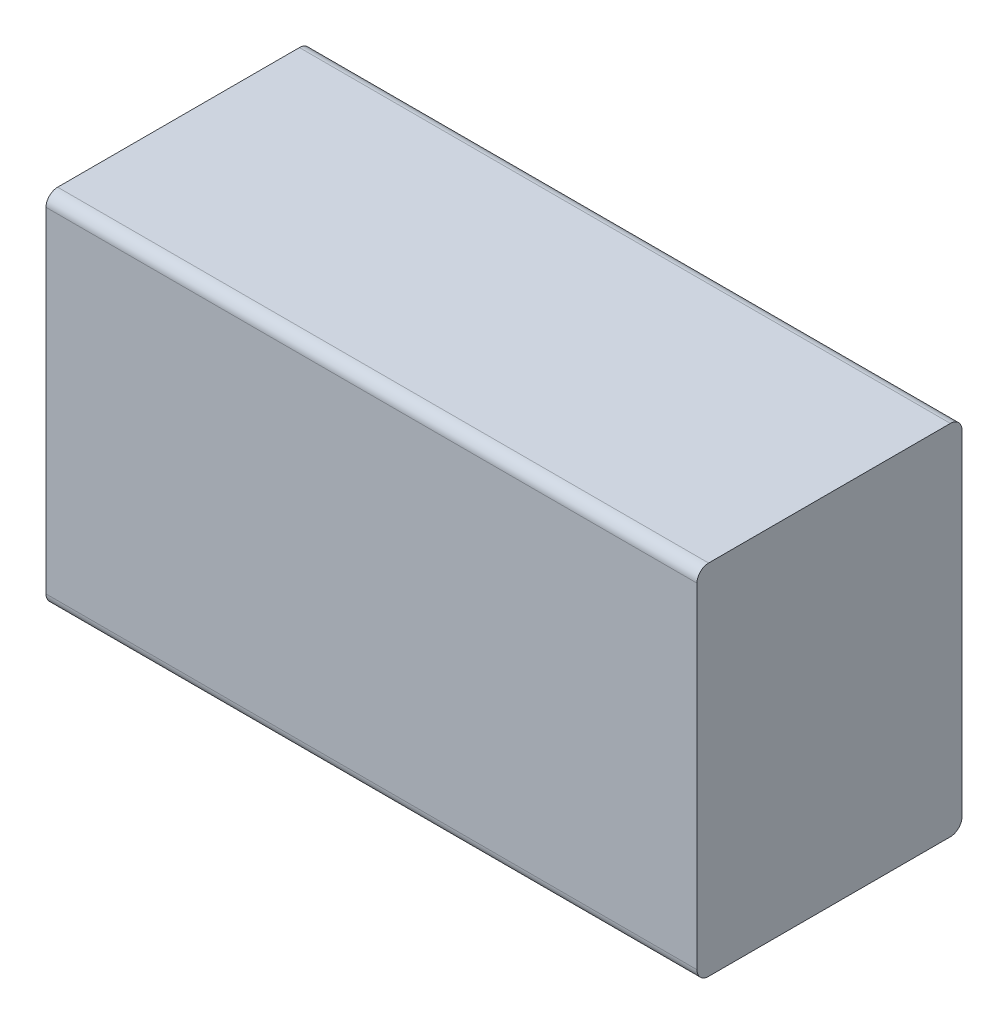
ISO-10303-21;
HEADER;
FILE_DESCRIPTION(('STEP AP214'),'2;1');
FILE_NAME('part.step','',(''),(''),'','','');
FILE_SCHEMA(('AUTOMOTIVE_DESIGN { 1 0 10303 214 1 1 1 1 }'));
ENDSEC;
DATA;
#1=APPLICATION_CONTEXT('core data for automotive mechanical design processes');
#2=APPLICATION_PROTOCOL_DEFINITION('international standard','automotive_design',2000,#1);
#3=PRODUCT_CONTEXT('',#1,'mechanical');
#4=PRODUCT('Part','Part','',(#3));
#5=PRODUCT_RELATED_PRODUCT_CATEGORY('part','',(#4));
#6=PRODUCT_DEFINITION_FORMATION('','',#4);
#7=PRODUCT_DEFINITION_CONTEXT('part definition',#1,'design');
#8=PRODUCT_DEFINITION('design','',#6,#7);
#9=PRODUCT_DEFINITION_SHAPE('','',#8);
#10=(LENGTH_UNIT() NAMED_UNIT(*) SI_UNIT(.MILLI.,.METRE.));
#11=(NAMED_UNIT(*) PLANE_ANGLE_UNIT() SI_UNIT($,.RADIAN.));
#12=(NAMED_UNIT(*) SI_UNIT($,.STERADIAN.) SOLID_ANGLE_UNIT());
#13=UNCERTAINTY_MEASURE_WITH_UNIT(LENGTH_MEASURE(1.E-05),#10,'distance_accuracy_value','');
#14=(GEOMETRIC_REPRESENTATION_CONTEXT(3) GLOBAL_UNCERTAINTY_ASSIGNED_CONTEXT((#13)) GLOBAL_UNIT_ASSIGNED_CONTEXT((#10,
#11,#12)) REPRESENTATION_CONTEXT('',''));
#15=CARTESIAN_POINT('',(0.,0.,0.));
#16=DIRECTION('',(0.,0.,1.));
#17=DIRECTION('',(1.,0.,0.));
#18=AXIS2_PLACEMENT_3D('',#15,#16,#17);
#19=CARTESIAN_POINT('',(-0.7,-0.385,0.3));
#20=DIRECTION('',(1.,0.,0.));
#21=DIRECTION('',(0.,1.,0.));
#22=AXIS2_PLACEMENT_3D('',#19,#20,#21);
#23=PLANE('',#22);
#24=DIRECTION('',(0.,0.,-1.));
#25=VECTOR('',#24,1.);
#26=CARTESIAN_POINT('',(-0.7,0.385,0.3));
#27=LINE('',#26,#25);
#28=CARTESIAN_POINT('',(-0.7,0.385,0.56));
#29=VERTEX_POINT('',#28);
#30=CARTESIAN_POINT('',(-0.7,0.385,0.04));
#31=VERTEX_POINT('',#30);
#32=EDGE_CURVE('E42',#29,#31,#27,.T.);
#33=ORIENTED_EDGE('',*,*,#32,.T.);
#34=CARTESIAN_POINT('',(-0.7,0.36,0.04));
#35=DIRECTION('',(-1.,0.,0.));
#36=DIRECTION('',(0.,0.,-1.));
#37=AXIS2_PLACEMENT_3D('',#34,#35,#36);
#38=CIRCLE('',#37,0.025);
#39=CARTESIAN_POINT('',(-0.7,0.36,0.015));
#40=VERTEX_POINT('',#39);
#41=EDGE_CURVE('E139',#31,#40,#38,.T.);
#42=ORIENTED_EDGE('',*,*,#41,.T.);
#43=DIRECTION('',(0.,1.,0.));
#44=VECTOR('',#43,1.);
#45=CARTESIAN_POINT('',(-0.7,-0.385,0.015));
#46=LINE('',#45,#44);
#47=CARTESIAN_POINT('',(-0.7,-0.36,0.015));
#48=VERTEX_POINT('',#47);
#49=EDGE_CURVE('E28',#48,#40,#46,.T.);
#50=ORIENTED_EDGE('',*,*,#49,.F.);
#51=CARTESIAN_POINT('',(-0.7,-0.36,0.04));
#52=DIRECTION('',(-1.,0.,0.));
#53=DIRECTION('',(0.,0.,-1.));
#54=AXIS2_PLACEMENT_3D('',#51,#52,#53);
#55=CIRCLE('',#54,0.025);
#56=CARTESIAN_POINT('',(-0.7,-0.385,0.04));
#57=VERTEX_POINT('',#56);
#58=EDGE_CURVE('E157',#48,#57,#55,.T.);
#59=ORIENTED_EDGE('',*,*,#58,.T.);
#60=DIRECTION('',(0.,0.,-1.));
#61=VECTOR('',#60,1.);
#62=CARTESIAN_POINT('',(-0.7,-0.385,0.3));
#63=LINE('',#62,#61);
#64=CARTESIAN_POINT('',(-0.7,-0.385,0.56));
#65=VERTEX_POINT('',#64);
#66=EDGE_CURVE('E110',#65,#57,#63,.T.);
#67=ORIENTED_EDGE('',*,*,#66,.F.);
#68=CARTESIAN_POINT('',(-0.7,-0.36,0.56));
#69=DIRECTION('',(-1.,0.,0.));
#70=DIRECTION('',(0.,0.,-1.));
#71=AXIS2_PLACEMENT_3D('',#68,#69,#70);
#72=CIRCLE('',#71,0.025);
#73=CARTESIAN_POINT('',(-0.7,-0.36,0.585));
#74=VERTEX_POINT('',#73);
#75=EDGE_CURVE('E119',#65,#74,#72,.T.);
#76=ORIENTED_EDGE('',*,*,#75,.T.);
#77=DIRECTION('',(0.,1.,0.));
#78=VECTOR('',#77,1.);
#79=CARTESIAN_POINT('',(-0.7,-0.385,0.585));
#80=LINE('',#79,#78);
#81=CARTESIAN_POINT('',(-0.7,0.36,0.585));
#82=VERTEX_POINT('',#81);
#83=EDGE_CURVE('E21',#74,#82,#80,.T.);
#84=ORIENTED_EDGE('',*,*,#83,.T.);
#85=CARTESIAN_POINT('',(-0.7,0.36,0.56));
#86=DIRECTION('',(-1.,0.,0.));
#87=DIRECTION('',(0.,0.,-1.));
#88=AXIS2_PLACEMENT_3D('',#85,#86,#87);
#89=CIRCLE('',#88,0.025);
#90=EDGE_CURVE('E193',#82,#29,#89,.T.);
#91=ORIENTED_EDGE('',*,*,#90,.T.);
#92=EDGE_LOOP('',(#33,#42,#50,#59,#67,#76,#84,#91));
#93=FACE_BOUND('',#92,.T.);
#94=ADVANCED_FACE('F17',(#93),#23,.F.);
#95=CARTESIAN_POINT('',(0.7,-0.385,0.3));
#96=DIRECTION('',(1.,0.,0.));
#97=DIRECTION('',(0.,1.,0.));
#98=AXIS2_PLACEMENT_3D('',#95,#96,#97);
#99=PLANE('',#98);
#100=DIRECTION('',(0.,1.,0.));
#101=VECTOR('',#100,1.);
#102=CARTESIAN_POINT('',(0.7,-0.385,0.015));
#103=LINE('',#102,#101);
#104=CARTESIAN_POINT('',(0.7,-0.36,0.015));
#105=VERTEX_POINT('',#104);
#106=CARTESIAN_POINT('',(0.7,0.36,0.015));
#107=VERTEX_POINT('',#106);
#108=EDGE_CURVE('E11',#105,#107,#103,.T.);
#109=ORIENTED_EDGE('',*,*,#108,.T.);
#110=CARTESIAN_POINT('',(0.7,0.36,0.04));
#111=DIRECTION('',(1.,0.,0.));
#112=DIRECTION('',(0.,0.,-1.));
#113=AXIS2_PLACEMENT_3D('',#110,#111,#112);
#114=CIRCLE('',#113,0.025);
#115=CARTESIAN_POINT('',(0.7,0.385,0.04));
#116=VERTEX_POINT('',#115);
#117=EDGE_CURVE('E147',#107,#116,#114,.T.);
#118=ORIENTED_EDGE('',*,*,#117,.T.);
#119=DIRECTION('',(0.,0.,-1.));
#120=VECTOR('',#119,1.);
#121=CARTESIAN_POINT('',(0.7,0.385,0.3));
#122=LINE('',#121,#120);
#123=CARTESIAN_POINT('',(0.7,0.385,0.56));
#124=VERTEX_POINT('',#123);
#125=EDGE_CURVE('E144',#124,#116,#122,.T.);
#126=ORIENTED_EDGE('',*,*,#125,.F.);
#127=CARTESIAN_POINT('',(0.7,0.36,0.56));
#128=DIRECTION('',(1.,0.,0.));
#129=DIRECTION('',(0.,0.,-1.));
#130=AXIS2_PLACEMENT_3D('',#127,#128,#129);
#131=CIRCLE('',#130,0.025);
#132=CARTESIAN_POINT('',(0.7,0.36,0.585));
#133=VERTEX_POINT('',#132);
#134=EDGE_CURVE('E156',#124,#133,#131,.T.);
#135=ORIENTED_EDGE('',*,*,#134,.T.);
#136=DIRECTION('',(0.,1.,0.));
#137=VECTOR('',#136,1.);
#138=CARTESIAN_POINT('',(0.7,-0.385,0.585));
#139=LINE('',#138,#137);
#140=CARTESIAN_POINT('',(0.7,-0.36,0.585));
#141=VERTEX_POINT('',#140);
#142=EDGE_CURVE('E126',#141,#133,#139,.T.);
#143=ORIENTED_EDGE('',*,*,#142,.F.);
#144=CARTESIAN_POINT('',(0.7,-0.36,0.56));
#145=DIRECTION('',(1.,0.,0.));
#146=DIRECTION('',(0.,0.,-1.));
#147=AXIS2_PLACEMENT_3D('',#144,#145,#146);
#148=CIRCLE('',#147,0.025);
#149=CARTESIAN_POINT('',(0.7,-0.385,0.56));
#150=VERTEX_POINT('',#149);
#151=EDGE_CURVE('E117',#141,#150,#148,.T.);
#152=ORIENTED_EDGE('',*,*,#151,.T.);
#153=DIRECTION('',(0.,0.,-1.));
#154=VECTOR('',#153,1.);
#155=CARTESIAN_POINT('',(0.7,-0.385,0.3));
#156=LINE('',#155,#154);
#157=CARTESIAN_POINT('',(0.7,-0.385,0.04));
#158=VERTEX_POINT('',#157);
#159=EDGE_CURVE('E98',#150,#158,#156,.T.);
#160=ORIENTED_EDGE('',*,*,#159,.T.);
#161=CARTESIAN_POINT('',(0.7,-0.36,0.04));
#162=DIRECTION('',(1.,0.,0.));
#163=DIRECTION('',(0.,0.,-1.));
#164=AXIS2_PLACEMENT_3D('',#161,#162,#163);
#165=CIRCLE('',#164,0.025);
#166=EDGE_CURVE('E121',#158,#105,#165,.T.);
#167=ORIENTED_EDGE('',*,*,#166,.T.);
#168=EDGE_LOOP('',(#109,#118,#126,#135,#143,#152,#160,#167));
#169=FACE_BOUND('',#168,.T.);
#170=ADVANCED_FACE('F123',(#169),#99,.T.);
#171=CARTESIAN_POINT('',(0.,-0.385,0.015));
#172=DIRECTION('',(0.,0.,-1.));
#173=DIRECTION('',(0.,-1.,0.));
#174=AXIS2_PLACEMENT_3D('',#171,#172,#173);
#175=PLANE('',#174);
#176=ORIENTED_EDGE('',*,*,#49,.T.);
#177=DIRECTION('',(1.,0.,0.));
#178=VECTOR('',#177,1.);
#179=CARTESIAN_POINT('',(0.,0.36,0.015));
#180=LINE('',#179,#178);
#181=EDGE_CURVE('E141',#40,#107,#180,.T.);
#182=ORIENTED_EDGE('',*,*,#181,.T.);
#183=ORIENTED_EDGE('',*,*,#108,.F.);
#184=DIRECTION('',(-1.,0.,0.));
#185=VECTOR('',#184,1.);
#186=CARTESIAN_POINT('',(0.,-0.36,0.015));
#187=LINE('',#186,#185);
#188=EDGE_CURVE('E152',#105,#48,#187,.T.);
#189=ORIENTED_EDGE('',*,*,#188,.T.);
#190=EDGE_LOOP('',(#176,#182,#183,#189));
#191=FACE_BOUND('',#190,.T.);
#192=ADVANCED_FACE('F19',(#191),#175,.T.);
#193=CARTESIAN_POINT('',(0.,-0.385,0.585));
#194=DIRECTION('',(0.,0.,-1.));
#195=DIRECTION('',(0.,-1.,0.));
#196=AXIS2_PLACEMENT_3D('',#193,#194,#195);
#197=PLANE('',#196);
#198=ORIENTED_EDGE('',*,*,#142,.T.);
#199=DIRECTION('',(-1.,0.,0.));
#200=VECTOR('',#199,1.);
#201=CARTESIAN_POINT('',(-0.7,0.36,0.585));
#202=LINE('',#201,#200);
#203=EDGE_CURVE('E151',#133,#82,#202,.T.);
#204=ORIENTED_EDGE('',*,*,#203,.T.);
#205=ORIENTED_EDGE('',*,*,#83,.F.);
#206=DIRECTION('',(1.,0.,0.));
#207=VECTOR('',#206,1.);
#208=CARTESIAN_POINT('',(0.7,-0.36,0.585));
#209=LINE('',#208,#207);
#210=EDGE_CURVE('E129',#74,#141,#209,.T.);
#211=ORIENTED_EDGE('',*,*,#210,.T.);
#212=EDGE_LOOP('',(#198,#204,#205,#211));
#213=FACE_BOUND('',#212,.T.);
#214=ADVANCED_FACE('F215',(#213),#197,.F.);
#215=CARTESIAN_POINT('',(0.,0.385,0.3));
#216=DIRECTION('',(0.,1.,0.));
#217=DIRECTION('',(1.,0.,0.));
#218=AXIS2_PLACEMENT_3D('',#215,#216,#217);
#219=PLANE('',#218);
#220=ORIENTED_EDGE('',*,*,#125,.T.);
#221=DIRECTION('',(-1.,0.,0.));
#222=VECTOR('',#221,1.);
#223=CARTESIAN_POINT('',(0.,0.385,0.04));
#224=LINE('',#223,#222);
#225=EDGE_CURVE('E111',#116,#31,#224,.T.);
#226=ORIENTED_EDGE('',*,*,#225,.T.);
#227=ORIENTED_EDGE('',*,*,#32,.F.);
#228=DIRECTION('',(1.,0.,0.));
#229=VECTOR('',#228,1.);
#230=CARTESIAN_POINT('',(0.7,0.385,0.56));
#231=LINE('',#230,#229);
#232=EDGE_CURVE('E161',#29,#124,#231,.T.);
#233=ORIENTED_EDGE('',*,*,#232,.T.);
#234=EDGE_LOOP('',(#220,#226,#227,#233));
#235=FACE_BOUND('',#234,.T.);
#236=ADVANCED_FACE('F168',(#235),#219,.T.);
#237=CARTESIAN_POINT('',(0.,-0.385,0.3));
#238=DIRECTION('',(0.,-1.,0.));
#239=DIRECTION('',(0.,0.,-1.));
#240=AXIS2_PLACEMENT_3D('',#237,#238,#239);
#241=PLANE('',#240);
#242=ORIENTED_EDGE('',*,*,#159,.F.);
#243=DIRECTION('',(-1.,0.,0.));
#244=VECTOR('',#243,1.);
#245=CARTESIAN_POINT('',(-0.7,-0.385,0.56));
#246=LINE('',#245,#244);
#247=EDGE_CURVE('E101',#150,#65,#246,.T.);
#248=ORIENTED_EDGE('',*,*,#247,.T.);
#249=ORIENTED_EDGE('',*,*,#66,.T.);
#250=DIRECTION('',(1.,0.,0.));
#251=VECTOR('',#250,1.);
#252=CARTESIAN_POINT('',(0.,-0.385,0.04));
#253=LINE('',#252,#251);
#254=EDGE_CURVE('E104',#57,#158,#253,.T.);
#255=ORIENTED_EDGE('',*,*,#254,.T.);
#256=EDGE_LOOP('',(#242,#248,#249,#255));
#257=FACE_BOUND('',#256,.T.);
#258=ADVANCED_FACE('F100',(#257),#241,.T.);
#259=CARTESIAN_POINT('',(0.,0.36,0.04));
#260=DIRECTION('',(1.,0.,0.));
#261=DIRECTION('',(0.,0.,1.));
#262=AXIS2_PLACEMENT_3D('',#259,#260,#261);
#263=CYLINDRICAL_SURFACE('',#262,0.025);
#264=ORIENTED_EDGE('',*,*,#117,.F.);
#265=ORIENTED_EDGE('',*,*,#181,.F.);
#266=ORIENTED_EDGE('',*,*,#41,.F.);
#267=ORIENTED_EDGE('',*,*,#225,.F.);
#268=EDGE_LOOP('',(#264,#265,#266,#267));
#269=FACE_BOUND('',#268,.T.);
#270=ADVANCED_FACE('F174',(#269),#263,.T.);
#271=CARTESIAN_POINT('',(0.,0.36,0.56));
#272=DIRECTION('',(-1.,0.,0.));
#273=DIRECTION('',(0.,0.,-1.));
#274=AXIS2_PLACEMENT_3D('',#271,#272,#273);
#275=CYLINDRICAL_SURFACE('',#274,0.025);
#276=ORIENTED_EDGE('',*,*,#134,.F.);
#277=ORIENTED_EDGE('',*,*,#232,.F.);
#278=ORIENTED_EDGE('',*,*,#90,.F.);
#279=ORIENTED_EDGE('',*,*,#203,.F.);
#280=EDGE_LOOP('',(#276,#277,#278,#279));
#281=FACE_BOUND('',#280,.T.);
#282=ADVANCED_FACE('F210',(#281),#275,.T.);
#283=CARTESIAN_POINT('',(0.,-0.36,0.04));
#284=DIRECTION('',(1.,0.,0.));
#285=DIRECTION('',(0.,0.,1.));
#286=AXIS2_PLACEMENT_3D('',#283,#284,#285);
#287=CYLINDRICAL_SURFACE('',#286,0.025);
#288=ORIENTED_EDGE('',*,*,#166,.F.);
#289=ORIENTED_EDGE('',*,*,#254,.F.);
#290=ORIENTED_EDGE('',*,*,#58,.F.);
#291=ORIENTED_EDGE('',*,*,#188,.F.);
#292=EDGE_LOOP('',(#288,#289,#290,#291));
#293=FACE_BOUND('',#292,.T.);
#294=ADVANCED_FACE('F182',(#293),#287,.T.);
#295=CARTESIAN_POINT('',(0.,-0.36,0.56));
#296=DIRECTION('',(-1.,0.,0.));
#297=DIRECTION('',(0.,0.,-1.));
#298=AXIS2_PLACEMENT_3D('',#295,#296,#297);
#299=CYLINDRICAL_SURFACE('',#298,0.025);
#300=ORIENTED_EDGE('',*,*,#151,.F.);
#301=ORIENTED_EDGE('',*,*,#210,.F.);
#302=ORIENTED_EDGE('',*,*,#75,.F.);
#303=ORIENTED_EDGE('',*,*,#247,.F.);
#304=EDGE_LOOP('',(#300,#301,#302,#303));
#305=FACE_BOUND('',#304,.T.);
#306=ADVANCED_FACE('F115',(#305),#299,.T.);
#307=CLOSED_SHELL('',(#94,#170,#192,#214,#236,#258,#270,#282,#294,#306));
#308=MANIFOLD_SOLID_BREP('B1',#307);
#309=ADVANCED_BREP_SHAPE_REPRESENTATION('',(#18,#308),#14);
#310=SHAPE_DEFINITION_REPRESENTATION(#9,#309);
ENDSEC;
END-ISO-10303-21;
